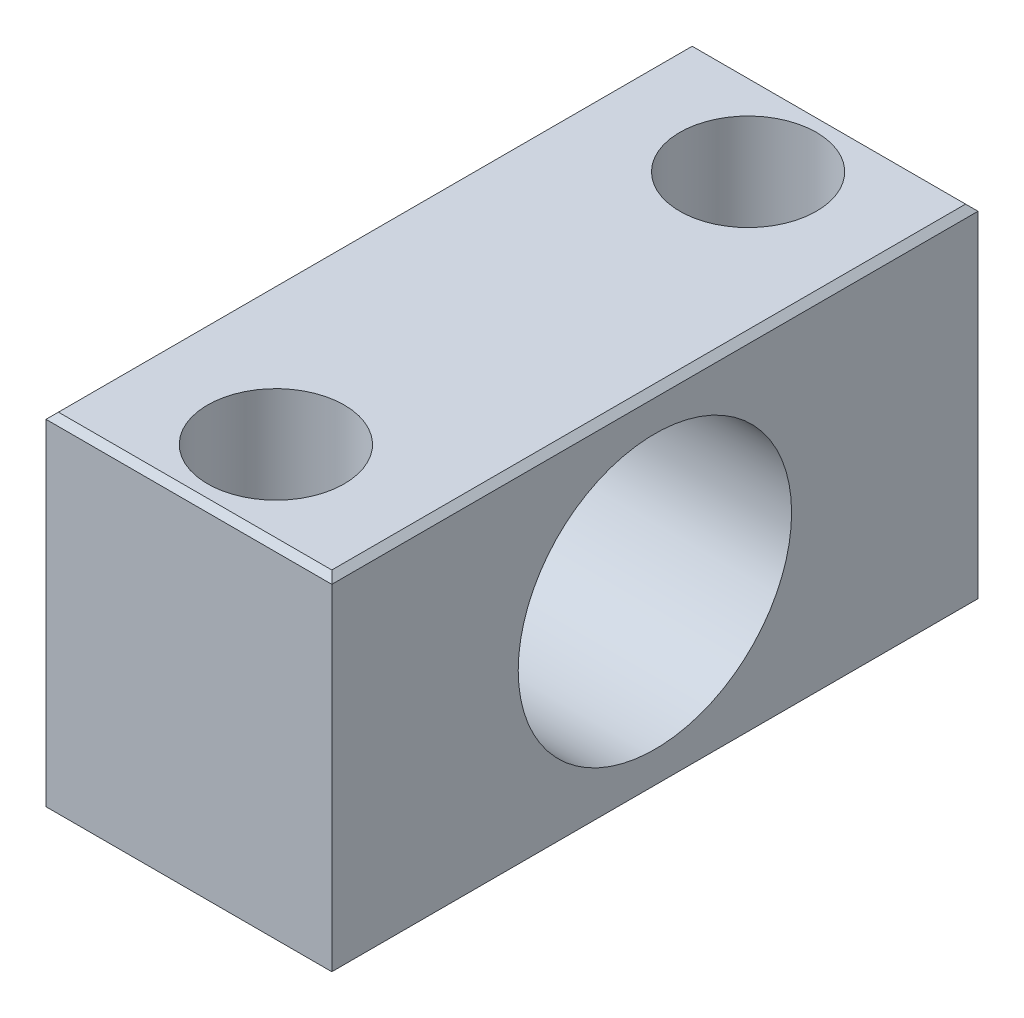
ISO-10303-21;
HEADER;
FILE_DESCRIPTION(('STEP AP214'),'2;1');
FILE_NAME('part.step','',(''),(''),'','','');
FILE_SCHEMA(('AUTOMOTIVE_DESIGN { 1 0 10303 214 1 1 1 1 }'));
ENDSEC;
DATA;
#1=APPLICATION_CONTEXT('core data for automotive mechanical design processes');
#2=APPLICATION_PROTOCOL_DEFINITION('international standard','automotive_design',2000,#1);
#3=PRODUCT_CONTEXT('',#1,'mechanical');
#4=PRODUCT('Part','Part','',(#3));
#5=PRODUCT_RELATED_PRODUCT_CATEGORY('part','',(#4));
#6=PRODUCT_DEFINITION_FORMATION('','',#4);
#7=PRODUCT_DEFINITION_CONTEXT('part definition',#1,'design');
#8=PRODUCT_DEFINITION('design','',#6,#7);
#9=PRODUCT_DEFINITION_SHAPE('','',#8);
#10=(LENGTH_UNIT() NAMED_UNIT(*) SI_UNIT(.MILLI.,.METRE.));
#11=(NAMED_UNIT(*) PLANE_ANGLE_UNIT() SI_UNIT($,.RADIAN.));
#12=(NAMED_UNIT(*) SI_UNIT($,.STERADIAN.) SOLID_ANGLE_UNIT());
#13=UNCERTAINTY_MEASURE_WITH_UNIT(LENGTH_MEASURE(1.E-05),#10,'distance_accuracy_value','');
#14=(GEOMETRIC_REPRESENTATION_CONTEXT(3) GLOBAL_UNCERTAINTY_ASSIGNED_CONTEXT((#13)) GLOBAL_UNIT_ASSIGNED_CONTEXT((#10,
#11,#12)) REPRESENTATION_CONTEXT('',''));
#15=CARTESIAN_POINT('',(0.,0.,0.));
#16=DIRECTION('',(0.,0.,1.));
#17=DIRECTION('',(1.,0.,0.));
#18=AXIS2_PLACEMENT_3D('',#15,#16,#17);
#19=CARTESIAN_POINT('',(15.75,-1.,19.));
#20=DIRECTION('',(0.,-1.,0.));
#21=DIRECTION('',(0.,0.,-1.));
#22=AXIS2_PLACEMENT_3D('',#19,#20,#21);
#23=PLANE('',#22);
#24=CARTESIAN_POINT('',(11.5,-1.,19.));
#25=DIRECTION('',(0.,-1.,0.));
#26=DIRECTION('',(0.,0.,-1.));
#27=AXIS2_PLACEMENT_3D('',#24,#25,#26);
#28=CIRCLE('',#27,3.);
#29=CARTESIAN_POINT('',(11.5,-1.,16.));
#30=VERTEX_POINT('',#29);
#31=EDGE_CURVE('E20',#30,#30,#28,.T.);
#32=ORIENTED_EDGE('',*,*,#31,.T.);
#33=EDGE_LOOP('',(#32));
#34=FACE_BOUND('',#33,.T.);
#35=CARTESIAN_POINT('',(11.5,-1.,19.));
#36=DIRECTION('',(0.,-1.,0.));
#37=DIRECTION('',(0.,0.,-1.));
#38=AXIS2_PLACEMENT_3D('',#35,#36,#37);
#39=CIRCLE('',#38,5.5);
#40=CARTESIAN_POINT('',(11.5,-1.,13.5));
#41=VERTEX_POINT('',#40);
#42=EDGE_CURVE('E148',#41,#41,#39,.F.);
#43=ORIENTED_EDGE('',*,*,#42,.T.);
#44=EDGE_LOOP('',(#43));
#45=FACE_BOUND('',#44,.T.);
#46=ADVANCED_FACE('F17',(#34,#45),#23,.F.);
#47=CARTESIAN_POINT('',(15.75,-1.,-19.));
#48=DIRECTION('',(0.,-1.,0.));
#49=DIRECTION('',(0.,0.,-1.));
#50=AXIS2_PLACEMENT_3D('',#47,#48,#49);
#51=PLANE('',#50);
#52=CARTESIAN_POINT('',(11.5,-1.,-19.));
#53=DIRECTION('',(0.,-1.,0.));
#54=DIRECTION('',(0.,0.,-1.));
#55=AXIS2_PLACEMENT_3D('',#52,#53,#54);
#56=CIRCLE('',#55,3.);
#57=CARTESIAN_POINT('',(11.5,-1.,-22.));
#58=VERTEX_POINT('',#57);
#59=EDGE_CURVE('E150',#58,#58,#56,.T.);
#60=ORIENTED_EDGE('',*,*,#59,.T.);
#61=EDGE_LOOP('',(#60));
#62=FACE_BOUND('',#61,.T.);
#63=CARTESIAN_POINT('',(11.5,-1.,-19.));
#64=DIRECTION('',(0.,-1.,0.));
#65=DIRECTION('',(0.,0.,-1.));
#66=AXIS2_PLACEMENT_3D('',#63,#64,#65);
#67=CIRCLE('',#66,5.5);
#68=CARTESIAN_POINT('',(11.5,-1.,-24.5));
#69=VERTEX_POINT('',#68);
#70=EDGE_CURVE('E145',#69,#69,#67,.F.);
#71=ORIENTED_EDGE('',*,*,#70,.T.);
#72=EDGE_LOOP('',(#71));
#73=FACE_BOUND('',#72,.T.);
#74=ADVANCED_FACE('F162',(#62,#73),#51,.F.);
#75=CARTESIAN_POINT('',(11.5,-7.5,19.));
#76=DIRECTION('',(0.,-1.,0.));
#77=DIRECTION('',(0.,0.,-1.));
#78=AXIS2_PLACEMENT_3D('',#75,#76,#77);
#79=CYLINDRICAL_SURFACE('',#78,3.);
#80=CARTESIAN_POINT('',(11.5,-14.,19.));
#81=DIRECTION('',(0.,-1.,0.));
#82=DIRECTION('',(0.,0.,-1.));
#83=AXIS2_PLACEMENT_3D('',#80,#81,#82);
#84=CIRCLE('',#83,3.);
#85=CARTESIAN_POINT('',(11.5,-14.,16.));
#86=VERTEX_POINT('',#85);
#87=EDGE_CURVE('E94',#86,#86,#84,.F.);
#88=ORIENTED_EDGE('',*,*,#87,.F.);
#89=EDGE_LOOP('',(#88));
#90=FACE_BOUND('',#89,.T.);
#91=ORIENTED_EDGE('',*,*,#31,.F.);
#92=EDGE_LOOP('',(#91));
#93=FACE_BOUND('',#92,.T.);
#94=ADVANCED_FACE('F159',(#90,#93),#79,.F.);
#95=CARTESIAN_POINT('',(11.5,-7.5,-19.));
#96=DIRECTION('',(0.,-1.,0.));
#97=DIRECTION('',(0.,0.,-1.));
#98=AXIS2_PLACEMENT_3D('',#95,#96,#97);
#99=CYLINDRICAL_SURFACE('',#98,3.);
#100=CARTESIAN_POINT('',(11.5,-14.,-19.));
#101=DIRECTION('',(0.,-1.,0.));
#102=DIRECTION('',(0.,0.,-1.));
#103=AXIS2_PLACEMENT_3D('',#100,#101,#102);
#104=CIRCLE('',#103,3.);
#105=CARTESIAN_POINT('',(11.5,-14.,-22.));
#106=VERTEX_POINT('',#105);
#107=EDGE_CURVE('E107',#106,#106,#104,.F.);
#108=ORIENTED_EDGE('',*,*,#107,.F.);
#109=EDGE_LOOP('',(#108));
#110=FACE_BOUND('',#109,.T.);
#111=ORIENTED_EDGE('',*,*,#59,.F.);
#112=EDGE_LOOP('',(#111));
#113=FACE_BOUND('',#112,.T.);
#114=ADVANCED_FACE('F161',(#110,#113),#99,.F.);
#115=CARTESIAN_POINT('',(13.5,0.,0.));
#116=DIRECTION('',(1.,0.,0.));
#117=DIRECTION('',(0.,0.,-1.));
#118=AXIS2_PLACEMENT_3D('',#115,#116,#117);
#119=CYLINDRICAL_SURFACE('',#118,11.);
#120=CARTESIAN_POINT('',(23.,0.,0.));
#121=DIRECTION('',(1.,0.,0.));
#122=DIRECTION('',(0.,0.,-1.));
#123=AXIS2_PLACEMENT_3D('',#120,#121,#122);
#124=CIRCLE('',#123,11.);
#125=CARTESIAN_POINT('',(23.,0.,-11.));
#126=VERTEX_POINT('',#125);
#127=EDGE_CURVE('E137',#126,#126,#124,.F.);
#128=ORIENTED_EDGE('',*,*,#127,.F.);
#129=EDGE_LOOP('',(#128));
#130=FACE_BOUND('',#129,.T.);
#131=CARTESIAN_POINT('',(4.,0.,0.));
#132=DIRECTION('',(1.,0.,0.));
#133=DIRECTION('',(0.,0.,-1.));
#134=AXIS2_PLACEMENT_3D('',#131,#132,#133);
#135=CIRCLE('',#134,11.);
#136=CARTESIAN_POINT('',(4.,0.,-11.));
#137=VERTEX_POINT('',#136);
#138=EDGE_CURVE('E118',#137,#137,#135,.F.);
#139=ORIENTED_EDGE('',*,*,#138,.T.);
#140=EDGE_LOOP('',(#139));
#141=FACE_BOUND('',#140,.T.);
#142=ADVANCED_FACE('F170',(#130,#141),#119,.F.);
#143=CARTESIAN_POINT('',(22.5,-14.,26.));
#144=DIRECTION('',(0.707106781186548,-0.707106781186548,0.));
#145=DIRECTION('',(0.707106781186548,0.707106781186548,0.));
#146=AXIS2_PLACEMENT_3D('',#143,#144,#145);
#147=PLANE('',#146);
#148=DIRECTION('',(-0.577350269189626,-0.577350269189626,-0.577350269189626));
#149=VECTOR('',#148,1.);
#150=CARTESIAN_POINT('',(23.,-13.5,26.));
#151=LINE('',#150,#149);
#152=CARTESIAN_POINT('',(23.,-13.5,26.));
#153=VERTEX_POINT('',#152);
#154=CARTESIAN_POINT('',(22.5,-14.,25.5));
#155=VERTEX_POINT('',#154);
#156=EDGE_CURVE('E99',#153,#155,#151,.T.);
#157=ORIENTED_EDGE('',*,*,#156,.T.);
#158=DIRECTION('',(0.,0.,-1.));
#159=VECTOR('',#158,1.);
#160=CARTESIAN_POINT('',(22.5,-14.,26.));
#161=LINE('',#160,#159);
#162=CARTESIAN_POINT('',(22.5,-14.,-25.5));
#163=VERTEX_POINT('',#162);
#164=EDGE_CURVE('E79',#163,#155,#161,.F.);
#165=ORIENTED_EDGE('',*,*,#164,.F.);
#166=DIRECTION('',(0.577350269189626,0.577350269189626,-0.577350269189626));
#167=VECTOR('',#166,1.);
#168=CARTESIAN_POINT('',(22.5,-14.,-25.5));
#169=LINE('',#168,#167);
#170=CARTESIAN_POINT('',(23.,-13.5,-26.));
#171=VERTEX_POINT('',#170);
#172=EDGE_CURVE('E85',#163,#171,#169,.T.);
#173=ORIENTED_EDGE('',*,*,#172,.T.);
#174=DIRECTION('',(0.,0.,-1.));
#175=VECTOR('',#174,1.);
#176=CARTESIAN_POINT('',(23.,-13.5,26.));
#177=LINE('',#176,#175);
#178=EDGE_CURVE('E488',#153,#171,#177,.T.);
#179=ORIENTED_EDGE('',*,*,#178,.F.);
#180=EDGE_LOOP('',(#157,#165,#173,#179));
#181=FACE_BOUND('',#180,.T.);
#182=ADVANCED_FACE('F97',(#181),#147,.T.);
#183=CARTESIAN_POINT('',(11.5,6.5,19.));
#184=DIRECTION('',(0.,-1.,0.));
#185=DIRECTION('',(0.,0.,-1.));
#186=AXIS2_PLACEMENT_3D('',#183,#184,#185);
#187=CYLINDRICAL_SURFACE('',#186,5.5);
#188=CARTESIAN_POINT('',(11.5,14.,19.));
#189=DIRECTION('',(0.,-1.,0.));
#190=DIRECTION('',(0.,0.,-1.));
#191=AXIS2_PLACEMENT_3D('',#188,#189,#190);
#192=CIRCLE('',#191,5.5);
#193=CARTESIAN_POINT('',(11.5,14.,13.5));
#194=VERTEX_POINT('',#193);
#195=EDGE_CURVE('E133',#194,#194,#192,.T.);
#196=ORIENTED_EDGE('',*,*,#195,.F.);
#197=EDGE_LOOP('',(#196));
#198=FACE_BOUND('',#197,.T.);
#199=ORIENTED_EDGE('',*,*,#42,.F.);
#200=EDGE_LOOP('',(#199));
#201=FACE_BOUND('',#200,.T.);
#202=ADVANCED_FACE('F237',(#198,#201),#187,.F.);
#203=CARTESIAN_POINT('',(11.5,6.5,-19.));
#204=DIRECTION('',(0.,-1.,0.));
#205=DIRECTION('',(0.,0.,-1.));
#206=AXIS2_PLACEMENT_3D('',#203,#204,#205);
#207=CYLINDRICAL_SURFACE('',#206,5.5);
#208=CARTESIAN_POINT('',(11.5,14.,-19.));
#209=DIRECTION('',(0.,-1.,0.));
#210=DIRECTION('',(0.,0.,-1.));
#211=AXIS2_PLACEMENT_3D('',#208,#209,#210);
#212=CIRCLE('',#211,5.5);
#213=CARTESIAN_POINT('',(11.5,14.,-24.5));
#214=VERTEX_POINT('',#213);
#215=EDGE_CURVE('E129',#214,#214,#212,.T.);
#216=ORIENTED_EDGE('',*,*,#215,.F.);
#217=EDGE_LOOP('',(#216));
#218=FACE_BOUND('',#217,.T.);
#219=ORIENTED_EDGE('',*,*,#70,.F.);
#220=EDGE_LOOP('',(#219));
#221=FACE_BOUND('',#220,.T.);
#222=ADVANCED_FACE('F233',(#218,#221),#207,.F.);
#223=CARTESIAN_POINT('',(23.,13.5,26.));
#224=DIRECTION('',(0.707106781186548,0.707106781186548,0.));
#225=DIRECTION('',(-0.707106781186548,0.707106781186548,0.));
#226=AXIS2_PLACEMENT_3D('',#223,#224,#225);
#227=PLANE('',#226);
#228=DIRECTION('',(0.577350269189626,-0.577350269189626,0.577350269189626));
#229=VECTOR('',#228,1.);
#230=CARTESIAN_POINT('',(22.5,14.,25.5));
#231=LINE('',#230,#229);
#232=CARTESIAN_POINT('',(22.5,14.,25.5));
#233=VERTEX_POINT('',#232);
#234=CARTESIAN_POINT('',(23.,13.5,26.));
#235=VERTEX_POINT('',#234);
#236=EDGE_CURVE('E136',#233,#235,#231,.T.);
#237=ORIENTED_EDGE('',*,*,#236,.T.);
#238=DIRECTION('',(0.,0.,-1.));
#239=VECTOR('',#238,1.);
#240=CARTESIAN_POINT('',(23.,13.5,26.));
#241=LINE('',#240,#239);
#242=CARTESIAN_POINT('',(23.,13.5,-26.));
#243=VERTEX_POINT('',#242);
#244=EDGE_CURVE('E139',#243,#235,#241,.F.);
#245=ORIENTED_EDGE('',*,*,#244,.F.);
#246=DIRECTION('',(-0.577350269189626,0.577350269189626,0.577350269189626));
#247=VECTOR('',#246,1.);
#248=CARTESIAN_POINT('',(23.,13.5,-26.));
#249=LINE('',#248,#247);
#250=CARTESIAN_POINT('',(22.5,14.,-25.5));
#251=VERTEX_POINT('',#250);
#252=EDGE_CURVE('E114',#243,#251,#249,.T.);
#253=ORIENTED_EDGE('',*,*,#252,.T.);
#254=DIRECTION('',(0.,0.,1.));
#255=VECTOR('',#254,1.);
#256=CARTESIAN_POINT('',(22.5,14.,26.));
#257=LINE('',#256,#255);
#258=EDGE_CURVE('E128',#233,#251,#257,.F.);
#259=ORIENTED_EDGE('',*,*,#258,.F.);
#260=EDGE_LOOP('',(#237,#245,#253,#259));
#261=FACE_BOUND('',#260,.T.);
#262=ADVANCED_FACE('F229',(#261),#227,.T.);
#263=CARTESIAN_POINT('',(4.,8.,0.));
#264=DIRECTION('',(-1.,0.,0.));
#265=DIRECTION('',(0.,0.,1.));
#266=AXIS2_PLACEMENT_3D('',#263,#264,#265);
#267=PLANE('',#266);
#268=ORIENTED_EDGE('',*,*,#138,.F.);
#269=EDGE_LOOP('',(#268));
#270=FACE_BOUND('',#269,.T.);
#271=CARTESIAN_POINT('',(4.,0.,0.));
#272=DIRECTION('',(1.,0.,0.));
#273=DIRECTION('',(0.,0.,-1.));
#274=AXIS2_PLACEMENT_3D('',#271,#272,#273);
#275=CIRCLE('',#274,5.);
#276=CARTESIAN_POINT('',(4.,0.,-5.));
#277=VERTEX_POINT('',#276);
#278=EDGE_CURVE('E124',#277,#277,#275,.F.);
#279=ORIENTED_EDGE('',*,*,#278,.T.);
#280=EDGE_LOOP('',(#279));
#281=FACE_BOUND('',#280,.T.);
#282=ADVANCED_FACE('F225',(#270,#281),#267,.F.);
#283=CARTESIAN_POINT('',(28.,14.,-25.5));
#284=DIRECTION('',(0.,-0.707106781186548,0.707106781186548));
#285=DIRECTION('',(0.,-0.707106781186548,-0.707106781186548));
#286=AXIS2_PLACEMENT_3D('',#283,#284,#285);
#287=PLANE('',#286);
#288=DIRECTION('',(1.,0.,0.));
#289=VECTOR('',#288,1.);
#290=CARTESIAN_POINT('',(0.,13.5,-26.));
#291=LINE('',#290,#289);
#292=CARTESIAN_POINT('',(0.,13.5,-26.));
#293=VERTEX_POINT('',#292);
#294=EDGE_CURVE('E504',#243,#293,#291,.F.);
#295=ORIENTED_EDGE('',*,*,#294,.T.);
#296=DIRECTION('',(-0.577350269189626,-0.577350269189626,-0.577350269189626));
#297=VECTOR('',#296,1.);
#298=CARTESIAN_POINT('',(0.499999999999987,14.,-25.5));
#299=LINE('',#298,#297);
#300=CARTESIAN_POINT('',(0.49999999999999,14.,-25.5));
#301=VERTEX_POINT('',#300);
#302=EDGE_CURVE('E116',#301,#293,#299,.T.);
#303=ORIENTED_EDGE('',*,*,#302,.F.);
#304=DIRECTION('',(1.,0.,0.));
#305=VECTOR('',#304,1.);
#306=CARTESIAN_POINT('',(22.5,14.,-25.5));
#307=LINE('',#306,#305);
#308=EDGE_CURVE('E132',#251,#301,#307,.F.);
#309=ORIENTED_EDGE('',*,*,#308,.F.);
#310=ORIENTED_EDGE('',*,*,#252,.F.);
#311=EDGE_LOOP('',(#295,#303,#309,#310));
#312=FACE_BOUND('',#311,.T.);
#313=ADVANCED_FACE('F222',(#312),#287,.F.);
#314=CARTESIAN_POINT('',(28.,-13.5,-26.));
#315=DIRECTION('',(0.,0.707106781186548,0.707106781186548));
#316=DIRECTION('',(0.,-0.707106781186548,0.707106781186548));
#317=AXIS2_PLACEMENT_3D('',#314,#315,#316);
#318=PLANE('',#317);
#319=DIRECTION('',(1.,0.,0.));
#320=VECTOR('',#319,1.);
#321=CARTESIAN_POINT('',(0.5,-14.,-25.5));
#322=LINE('',#321,#320);
#323=CARTESIAN_POINT('',(0.499999999999985,-14.,-25.5));
#324=VERTEX_POINT('',#323);
#325=EDGE_CURVE('E87',#324,#163,#322,.T.);
#326=ORIENTED_EDGE('',*,*,#325,.F.);
#327=DIRECTION('',(0.577350269189626,-0.577350269189626,0.577350269189626));
#328=VECTOR('',#327,1.);
#329=CARTESIAN_POINT('',(0.,-13.5,-26.));
#330=LINE('',#329,#328);
#331=CARTESIAN_POINT('',(0.,-13.5,-26.));
#332=VERTEX_POINT('',#331);
#333=EDGE_CURVE('E95',#332,#324,#330,.T.);
#334=ORIENTED_EDGE('',*,*,#333,.F.);
#335=DIRECTION('',(1.,0.,0.));
#336=VECTOR('',#335,1.);
#337=CARTESIAN_POINT('',(0.,-13.5,-26.));
#338=LINE('',#337,#336);
#339=EDGE_CURVE('E90',#332,#171,#338,.T.);
#340=ORIENTED_EDGE('',*,*,#339,.T.);
#341=ORIENTED_EDGE('',*,*,#172,.F.);
#342=EDGE_LOOP('',(#326,#334,#340,#341));
#343=FACE_BOUND('',#342,.T.);
#344=ADVANCED_FACE('F86',(#343),#318,.F.);
#345=CARTESIAN_POINT('',(0.5,-14.,26.));
#346=DIRECTION('',(0.,-1.,0.));
#347=DIRECTION('',(0.,0.,-1.));
#348=AXIS2_PLACEMENT_3D('',#345,#346,#347);
#349=PLANE('',#348);
#350=DIRECTION('',(1.,0.,0.));
#351=VECTOR('',#350,1.);
#352=CARTESIAN_POINT('',(28.,-14.,25.5));
#353=LINE('',#352,#351);
#354=CARTESIAN_POINT('',(0.499999999999991,-14.,25.5));
#355=VERTEX_POINT('',#354);
#356=EDGE_CURVE('E101',#155,#355,#353,.F.);
#357=ORIENTED_EDGE('',*,*,#356,.T.);
#358=DIRECTION('',(0.,0.,1.));
#359=VECTOR('',#358,1.);
#360=CARTESIAN_POINT('',(0.5,-14.,26.));
#361=LINE('',#360,#359);
#362=EDGE_CURVE('E106',#324,#355,#361,.T.);
#363=ORIENTED_EDGE('',*,*,#362,.F.);
#364=ORIENTED_EDGE('',*,*,#325,.T.);
#365=ORIENTED_EDGE('',*,*,#164,.T.);
#366=EDGE_LOOP('',(#357,#363,#364,#365));
#367=FACE_BOUND('',#366,.T.);
#368=ORIENTED_EDGE('',*,*,#107,.T.);
#369=EDGE_LOOP('',(#368));
#370=FACE_BOUND('',#369,.T.);
#371=ORIENTED_EDGE('',*,*,#87,.T.);
#372=EDGE_LOOP('',(#371));
#373=FACE_BOUND('',#372,.T.);
#374=ADVANCED_FACE('F103',(#367,#370,#373),#349,.T.);
#375=CARTESIAN_POINT('',(28.,-14.,25.5));
#376=DIRECTION('',(0.,0.707106781186548,-0.707106781186548));
#377=DIRECTION('',(0.,0.707106781186548,0.707106781186548));
#378=AXIS2_PLACEMENT_3D('',#375,#376,#377);
#379=PLANE('',#378);
#380=DIRECTION('',(1.,0.,0.));
#381=VECTOR('',#380,1.);
#382=CARTESIAN_POINT('',(0.,-13.5,26.));
#383=LINE('',#382,#381);
#384=CARTESIAN_POINT('',(0.,-13.5,26.));
#385=VERTEX_POINT('',#384);
#386=EDGE_CURVE('E494',#385,#153,#383,.T.);
#387=ORIENTED_EDGE('',*,*,#386,.F.);
#388=DIRECTION('',(-0.577350269189626,0.577350269189626,0.577350269189626));
#389=VECTOR('',#388,1.);
#390=CARTESIAN_POINT('',(0.5,-14.,25.5));
#391=LINE('',#390,#389);
#392=EDGE_CURVE('E500',#355,#385,#391,.T.);
#393=ORIENTED_EDGE('',*,*,#392,.F.);
#394=ORIENTED_EDGE('',*,*,#356,.F.);
#395=ORIENTED_EDGE('',*,*,#156,.F.);
#396=EDGE_LOOP('',(#387,#393,#394,#395));
#397=FACE_BOUND('',#396,.T.);
#398=ADVANCED_FACE('F213',(#397),#379,.F.);
#399=CARTESIAN_POINT('',(23.,-13.5,26.));
#400=DIRECTION('',(1.,0.,0.));
#401=DIRECTION('',(0.,0.,-1.));
#402=AXIS2_PLACEMENT_3D('',#399,#400,#401);
#403=PLANE('',#402);
#404=DIRECTION('',(0.,1.,0.));
#405=VECTOR('',#404,1.);
#406=CARTESIAN_POINT('',(23.,0.,26.));
#407=LINE('',#406,#405);
#408=EDGE_CURVE('E485',#153,#235,#407,.T.);
#409=ORIENTED_EDGE('',*,*,#408,.F.);
#410=ORIENTED_EDGE('',*,*,#178,.T.);
#411=DIRECTION('',(0.,1.,0.));
#412=VECTOR('',#411,1.);
#413=CARTESIAN_POINT('',(23.,0.,-26.));
#414=LINE('',#413,#412);
#415=EDGE_CURVE('E127',#171,#243,#414,.T.);
#416=ORIENTED_EDGE('',*,*,#415,.T.);
#417=ORIENTED_EDGE('',*,*,#244,.T.);
#418=EDGE_LOOP('',(#409,#410,#416,#417));
#419=FACE_BOUND('',#418,.T.);
#420=ORIENTED_EDGE('',*,*,#127,.T.);
#421=EDGE_LOOP('',(#420));
#422=FACE_BOUND('',#421,.T.);
#423=ADVANCED_FACE('F210',(#419,#422),#403,.T.);
#424=CARTESIAN_POINT('',(28.,13.5,26.));
#425=DIRECTION('',(0.,-0.707106781186548,-0.707106781186548));
#426=DIRECTION('',(0.,0.707106781186548,-0.707106781186548));
#427=AXIS2_PLACEMENT_3D('',#424,#425,#426);
#428=PLANE('',#427);
#429=DIRECTION('',(1.,0.,0.));
#430=VECTOR('',#429,1.);
#431=CARTESIAN_POINT('',(22.5,14.,25.5));
#432=LINE('',#431,#430);
#433=CARTESIAN_POINT('',(0.499999999999987,14.,25.5));
#434=VERTEX_POINT('',#433);
#435=EDGE_CURVE('E509',#434,#233,#432,.T.);
#436=ORIENTED_EDGE('',*,*,#435,.F.);
#437=DIRECTION('',(0.577350269189626,0.577350269189626,-0.577350269189626));
#438=VECTOR('',#437,1.);
#439=CARTESIAN_POINT('',(0.,13.5,26.));
#440=LINE('',#439,#438);
#441=CARTESIAN_POINT('',(0.,13.5,26.));
#442=VERTEX_POINT('',#441);
#443=EDGE_CURVE('E35',#442,#434,#440,.T.);
#444=ORIENTED_EDGE('',*,*,#443,.F.);
#445=DIRECTION('',(1.,0.,0.));
#446=VECTOR('',#445,1.);
#447=CARTESIAN_POINT('',(0.,13.5,26.));
#448=LINE('',#447,#446);
#449=EDGE_CURVE('E490',#235,#442,#448,.F.);
#450=ORIENTED_EDGE('',*,*,#449,.F.);
#451=ORIENTED_EDGE('',*,*,#236,.F.);
#452=EDGE_LOOP('',(#436,#444,#450,#451));
#453=FACE_BOUND('',#452,.T.);
#454=ADVANCED_FACE('F206',(#453),#428,.F.);
#455=CARTESIAN_POINT('',(22.5,14.,26.));
#456=DIRECTION('',(0.,1.,0.));
#457=DIRECTION('',(0.,0.,1.));
#458=AXIS2_PLACEMENT_3D('',#455,#456,#457);
#459=PLANE('',#458);
#460=ORIENTED_EDGE('',*,*,#435,.T.);
#461=ORIENTED_EDGE('',*,*,#258,.T.);
#462=ORIENTED_EDGE('',*,*,#308,.T.);
#463=DIRECTION('',(0.,0.,1.));
#464=VECTOR('',#463,1.);
#465=CARTESIAN_POINT('',(0.5,14.,26.));
#466=LINE('',#465,#464);
#467=EDGE_CURVE('E123',#434,#301,#466,.F.);
#468=ORIENTED_EDGE('',*,*,#467,.F.);
#469=EDGE_LOOP('',(#460,#461,#462,#468));
#470=FACE_BOUND('',#469,.T.);
#471=ORIENTED_EDGE('',*,*,#215,.T.);
#472=EDGE_LOOP('',(#471));
#473=FACE_BOUND('',#472,.T.);
#474=ORIENTED_EDGE('',*,*,#195,.T.);
#475=EDGE_LOOP('',(#474));
#476=FACE_BOUND('',#475,.T.);
#477=ADVANCED_FACE('F202',(#470,#473,#476),#459,.T.);
#478=CARTESIAN_POINT('',(2.,0.,0.));
#479=DIRECTION('',(1.,0.,0.));
#480=DIRECTION('',(0.,0.,-1.));
#481=AXIS2_PLACEMENT_3D('',#478,#479,#480);
#482=CYLINDRICAL_SURFACE('',#481,5.);
#483=CARTESIAN_POINT('',(0.,0.,0.));
#484=DIRECTION('',(1.,0.,0.));
#485=DIRECTION('',(0.,0.,-1.));
#486=AXIS2_PLACEMENT_3D('',#483,#484,#485);
#487=CIRCLE('',#486,5.);
#488=CARTESIAN_POINT('',(0.,0.,-5.));
#489=VERTEX_POINT('',#488);
#490=EDGE_CURVE('E119',#489,#489,#487,.T.);
#491=ORIENTED_EDGE('',*,*,#490,.F.);
#492=EDGE_LOOP('',(#491));
#493=FACE_BOUND('',#492,.T.);
#494=ORIENTED_EDGE('',*,*,#278,.F.);
#495=EDGE_LOOP('',(#494));
#496=FACE_BOUND('',#495,.T.);
#497=ADVANCED_FACE('F198',(#493,#496),#482,.F.);
#498=CARTESIAN_POINT('',(0.,0.,-26.));
#499=DIRECTION('',(0.,0.,1.));
#500=DIRECTION('',(1.,0.,0.));
#501=AXIS2_PLACEMENT_3D('',#498,#499,#500);
#502=PLANE('',#501);
#503=DIRECTION('',(0.,1.,0.));
#504=VECTOR('',#503,1.);
#505=CARTESIAN_POINT('',(0.,13.5,-26.));
#506=LINE('',#505,#504);
#507=EDGE_CURVE('E122',#293,#332,#506,.F.);
#508=ORIENTED_EDGE('',*,*,#507,.F.);
#509=ORIENTED_EDGE('',*,*,#294,.F.);
#510=ORIENTED_EDGE('',*,*,#415,.F.);
#511=ORIENTED_EDGE('',*,*,#339,.F.);
#512=EDGE_LOOP('',(#508,#509,#510,#511));
#513=FACE_BOUND('',#512,.T.);
#514=ADVANCED_FACE('F194',(#513),#502,.F.);
#515=CARTESIAN_POINT('',(0.,-13.5,26.));
#516=DIRECTION('',(-0.707106781186548,-0.707106781186548,0.));
#517=DIRECTION('',(0.707106781186548,-0.707106781186548,0.));
#518=AXIS2_PLACEMENT_3D('',#515,#516,#517);
#519=PLANE('',#518);
#520=ORIENTED_EDGE('',*,*,#333,.T.);
#521=ORIENTED_EDGE('',*,*,#362,.T.);
#522=ORIENTED_EDGE('',*,*,#392,.T.);
#523=DIRECTION('',(0.,0.,1.));
#524=VECTOR('',#523,1.);
#525=CARTESIAN_POINT('',(0.,-13.5,26.));
#526=LINE('',#525,#524);
#527=EDGE_CURVE('E518',#332,#385,#526,.T.);
#528=ORIENTED_EDGE('',*,*,#527,.F.);
#529=EDGE_LOOP('',(#520,#521,#522,#528));
#530=FACE_BOUND('',#529,.T.);
#531=ADVANCED_FACE('F190',(#530),#519,.T.);
#532=CARTESIAN_POINT('',(0.,0.,26.));
#533=DIRECTION('',(0.,0.,1.));
#534=DIRECTION('',(1.,0.,0.));
#535=AXIS2_PLACEMENT_3D('',#532,#533,#534);
#536=PLANE('',#535);
#537=ORIENTED_EDGE('',*,*,#449,.T.);
#538=DIRECTION('',(0.,1.,0.));
#539=VECTOR('',#538,1.);
#540=CARTESIAN_POINT('',(0.,13.5,26.));
#541=LINE('',#540,#539);
#542=EDGE_CURVE('E26',#385,#442,#541,.T.);
#543=ORIENTED_EDGE('',*,*,#542,.F.);
#544=ORIENTED_EDGE('',*,*,#386,.T.);
#545=ORIENTED_EDGE('',*,*,#408,.T.);
#546=EDGE_LOOP('',(#537,#543,#544,#545));
#547=FACE_BOUND('',#546,.T.);
#548=ADVANCED_FACE('F182',(#547),#536,.T.);
#549=CARTESIAN_POINT('',(0.5,14.,26.));
#550=DIRECTION('',(-0.707106781186548,0.707106781186548,0.));
#551=DIRECTION('',(-0.707106781186548,-0.707106781186548,0.));
#552=AXIS2_PLACEMENT_3D('',#549,#550,#551);
#553=PLANE('',#552);
#554=ORIENTED_EDGE('',*,*,#302,.T.);
#555=DIRECTION('',(0.,0.,1.));
#556=VECTOR('',#555,1.);
#557=CARTESIAN_POINT('',(0.,13.5,26.));
#558=LINE('',#557,#556);
#559=EDGE_CURVE('E11',#442,#293,#558,.F.);
#560=ORIENTED_EDGE('',*,*,#559,.F.);
#561=ORIENTED_EDGE('',*,*,#443,.T.);
#562=ORIENTED_EDGE('',*,*,#467,.T.);
#563=EDGE_LOOP('',(#554,#560,#561,#562));
#564=FACE_BOUND('',#563,.T.);
#565=ADVANCED_FACE('F176',(#564),#553,.T.);
#566=CARTESIAN_POINT('',(0.,13.5,26.));
#567=DIRECTION('',(-1.,0.,0.));
#568=DIRECTION('',(0.,0.,1.));
#569=AXIS2_PLACEMENT_3D('',#566,#567,#568);
#570=PLANE('',#569);
#571=ORIENTED_EDGE('',*,*,#542,.T.);
#572=ORIENTED_EDGE('',*,*,#559,.T.);
#573=ORIENTED_EDGE('',*,*,#507,.T.);
#574=ORIENTED_EDGE('',*,*,#527,.T.);
#575=EDGE_LOOP('',(#571,#572,#573,#574));
#576=FACE_BOUND('',#575,.T.);
#577=ORIENTED_EDGE('',*,*,#490,.T.);
#578=EDGE_LOOP('',(#577));
#579=FACE_BOUND('',#578,.T.);
#580=ADVANCED_FACE('F174',(#576,#579),#570,.T.);
#581=CLOSED_SHELL('',(#46,#74,#94,#114,#142,#182,#202,#222,#262,#282,#313,#344,#374,#398,#423,
#454,#477,#497,#514,#531,#548,#565,#580));
#582=MANIFOLD_SOLID_BREP('B1',#581);
#583=ADVANCED_BREP_SHAPE_REPRESENTATION('',(#18,#582),#14);
#584=SHAPE_DEFINITION_REPRESENTATION(#9,#583);
ENDSEC;
END-ISO-10303-21;
